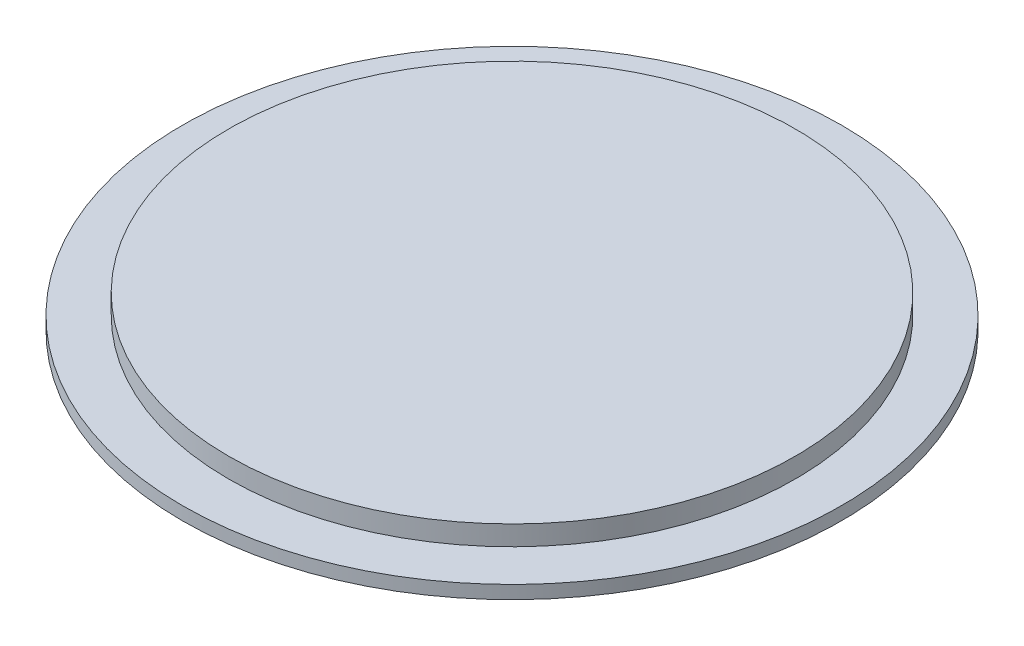
ISO-10303-21;
HEADER;
FILE_DESCRIPTION(('STEP AP214'),'2;1');
FILE_NAME('part.step','',(''),(''),'','','');
FILE_SCHEMA(('AUTOMOTIVE_DESIGN { 1 0 10303 214 1 1 1 1 }'));
ENDSEC;
DATA;
#1=APPLICATION_CONTEXT('core data for automotive mechanical design processes');
#2=APPLICATION_PROTOCOL_DEFINITION('international standard','automotive_design',2000,#1);
#3=PRODUCT_CONTEXT('',#1,'mechanical');
#4=PRODUCT('Part','Part','',(#3));
#5=PRODUCT_RELATED_PRODUCT_CATEGORY('part','',(#4));
#6=PRODUCT_DEFINITION_FORMATION('','',#4);
#7=PRODUCT_DEFINITION_CONTEXT('part definition',#1,'design');
#8=PRODUCT_DEFINITION('design','',#6,#7);
#9=PRODUCT_DEFINITION_SHAPE('','',#8);
#10=(LENGTH_UNIT() NAMED_UNIT(*) SI_UNIT(.MILLI.,.METRE.));
#11=(NAMED_UNIT(*) PLANE_ANGLE_UNIT() SI_UNIT($,.RADIAN.));
#12=(NAMED_UNIT(*) SI_UNIT($,.STERADIAN.) SOLID_ANGLE_UNIT());
#13=UNCERTAINTY_MEASURE_WITH_UNIT(LENGTH_MEASURE(1.E-05),#10,'distance_accuracy_value','');
#14=(GEOMETRIC_REPRESENTATION_CONTEXT(3) GLOBAL_UNCERTAINTY_ASSIGNED_CONTEXT((#13)) GLOBAL_UNIT_ASSIGNED_CONTEXT((#10,
#11,#12)) REPRESENTATION_CONTEXT('',''));
#15=CARTESIAN_POINT('',(0.,0.,0.));
#16=DIRECTION('',(0.,0.,1.));
#17=DIRECTION('',(1.,0.,0.));
#18=AXIS2_PLACEMENT_3D('',#15,#16,#17);
#19=CARTESIAN_POINT('',(0.,1.,0.));
#20=DIRECTION('',(0.,-1.,0.));
#21=DIRECTION('',(0.,0.,-1.));
#22=AXIS2_PLACEMENT_3D('',#19,#20,#21);
#23=CYLINDRICAL_SURFACE('',#22,25.);
#24=CARTESIAN_POINT('',(0.,1.,0.));
#25=DIRECTION('',(0.,1.,0.));
#26=DIRECTION('',(0.,0.,1.));
#27=AXIS2_PLACEMENT_3D('',#24,#25,#26);
#28=CIRCLE('',#27,25.);
#29=CARTESIAN_POINT('',(0.,1.,25.));
#30=VERTEX_POINT('',#29);
#31=EDGE_CURVE('E40',#30,#30,#28,.T.);
#32=ORIENTED_EDGE('',*,*,#31,.F.);
#33=EDGE_LOOP('',(#32));
#34=FACE_BOUND('',#33,.T.);
#35=CARTESIAN_POINT('',(0.,0.,0.));
#36=DIRECTION('',(0.,1.,0.));
#37=DIRECTION('',(0.,0.,1.));
#38=AXIS2_PLACEMENT_3D('',#35,#36,#37);
#39=CIRCLE('',#38,25.);
#40=CARTESIAN_POINT('',(0.,0.,25.));
#41=VERTEX_POINT('',#40);
#42=EDGE_CURVE('E36',#41,#41,#39,.T.);
#43=ORIENTED_EDGE('',*,*,#42,.T.);
#44=EDGE_LOOP('',(#43));
#45=FACE_BOUND('',#44,.T.);
#46=ADVANCED_FACE('F33',(#34,#45),#23,.T.);
#47=CARTESIAN_POINT('',(0.,1.,0.));
#48=DIRECTION('',(0.,1.,0.));
#49=DIRECTION('',(0.,0.,1.));
#50=AXIS2_PLACEMENT_3D('',#47,#48,#49);
#51=PLANE('',#50);
#52=CARTESIAN_POINT('',(0.,1.,0.));
#53=DIRECTION('',(0.,1.,0.));
#54=DIRECTION('',(0.,0.,1.));
#55=AXIS2_PLACEMENT_3D('',#52,#53,#54);
#56=CIRCLE('',#55,21.5);
#57=CARTESIAN_POINT('',(0.,1.,21.5));
#58=VERTEX_POINT('',#57);
#59=EDGE_CURVE('E10',#58,#58,#56,.T.);
#60=ORIENTED_EDGE('',*,*,#59,.F.);
#61=EDGE_LOOP('',(#60));
#62=FACE_BOUND('',#61,.T.);
#63=ORIENTED_EDGE('',*,*,#31,.T.);
#64=EDGE_LOOP('',(#63));
#65=FACE_BOUND('',#64,.T.);
#66=ADVANCED_FACE('F57',(#62,#65),#51,.T.);
#67=CARTESIAN_POINT('',(0.,0.,0.));
#68=DIRECTION('',(0.,1.,0.));
#69=DIRECTION('',(0.,0.,1.));
#70=AXIS2_PLACEMENT_3D('',#67,#68,#69);
#71=PLANE('',#70);
#72=ORIENTED_EDGE('',*,*,#42,.F.);
#73=EDGE_LOOP('',(#72));
#74=FACE_BOUND('',#73,.T.);
#75=ADVANCED_FACE('F54',(#74),#71,.F.);
#76=CARTESIAN_POINT('',(0.,2.5,0.));
#77=DIRECTION('',(0.,-1.,0.));
#78=DIRECTION('',(0.,0.,-1.));
#79=AXIS2_PLACEMENT_3D('',#76,#77,#78);
#80=CYLINDRICAL_SURFACE('',#79,21.5);
#81=CARTESIAN_POINT('',(0.,2.5,0.));
#82=DIRECTION('',(0.,1.,0.));
#83=DIRECTION('',(0.,0.,1.));
#84=AXIS2_PLACEMENT_3D('',#81,#82,#83);
#85=CIRCLE('',#84,21.5);
#86=CARTESIAN_POINT('',(0.,2.5,21.5));
#87=VERTEX_POINT('',#86);
#88=EDGE_CURVE('E46',#87,#87,#85,.T.);
#89=ORIENTED_EDGE('',*,*,#88,.F.);
#90=EDGE_LOOP('',(#89));
#91=FACE_BOUND('',#90,.T.);
#92=ORIENTED_EDGE('',*,*,#59,.T.);
#93=EDGE_LOOP('',(#92));
#94=FACE_BOUND('',#93,.T.);
#95=ADVANCED_FACE('F56',(#91,#94),#80,.T.);
#96=CARTESIAN_POINT('',(0.,2.5,0.));
#97=DIRECTION('',(0.,1.,0.));
#98=DIRECTION('',(0.,0.,1.));
#99=AXIS2_PLACEMENT_3D('',#96,#97,#98);
#100=PLANE('',#99);
#101=ORIENTED_EDGE('',*,*,#88,.T.);
#102=EDGE_LOOP('',(#101));
#103=FACE_BOUND('',#102,.T.);
#104=ADVANCED_FACE('F62',(#103),#100,.T.);
#105=CLOSED_SHELL('',(#46,#66,#75,#95,#104));
#106=MANIFOLD_SOLID_BREP('B2',#105);
#107=ADVANCED_BREP_SHAPE_REPRESENTATION('',(#18,#106),#14);
#108=SHAPE_DEFINITION_REPRESENTATION(#9,#107);
ENDSEC;
END-ISO-10303-21;
